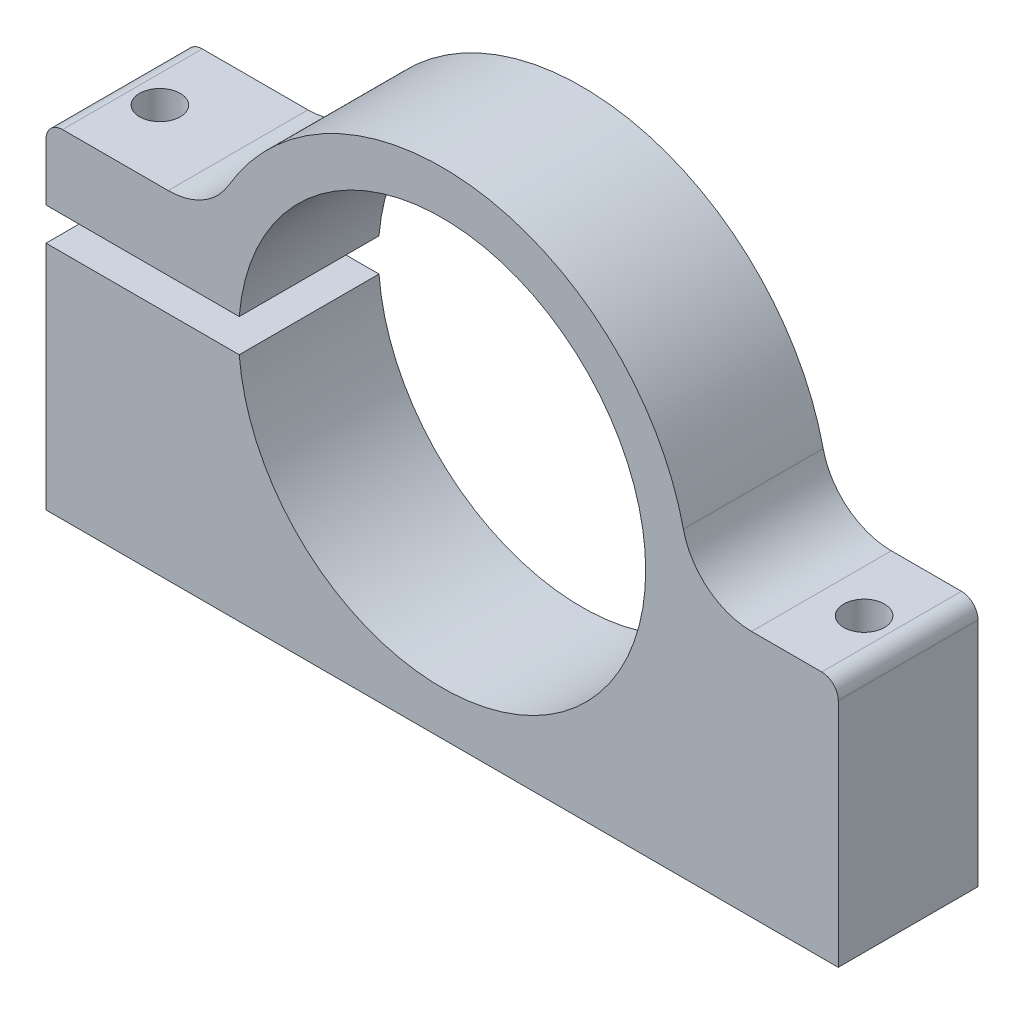
ISO-10303-21;
HEADER;
FILE_DESCRIPTION(('STEP AP214'),'2;1');
FILE_NAME('part.step','',(''),(''),'','','');
FILE_SCHEMA(('AUTOMOTIVE_DESIGN { 1 0 10303 214 1 1 1 1 }'));
ENDSEC;
DATA;
#1=APPLICATION_CONTEXT('core data for automotive mechanical design processes');
#2=APPLICATION_PROTOCOL_DEFINITION('international standard','automotive_design',2000,#1);
#3=PRODUCT_CONTEXT('',#1,'mechanical');
#4=PRODUCT('Part','Part','',(#3));
#5=PRODUCT_RELATED_PRODUCT_CATEGORY('part','',(#4));
#6=PRODUCT_DEFINITION_FORMATION('','',#4);
#7=PRODUCT_DEFINITION_CONTEXT('part definition',#1,'design');
#8=PRODUCT_DEFINITION('design','',#6,#7);
#9=PRODUCT_DEFINITION_SHAPE('','',#8);
#10=(LENGTH_UNIT() NAMED_UNIT(*) SI_UNIT(.MILLI.,.METRE.));
#11=(NAMED_UNIT(*) PLANE_ANGLE_UNIT() SI_UNIT($,.RADIAN.));
#12=(NAMED_UNIT(*) SI_UNIT($,.STERADIAN.) SOLID_ANGLE_UNIT());
#13=UNCERTAINTY_MEASURE_WITH_UNIT(LENGTH_MEASURE(1.E-05),#10,'distance_accuracy_value','');
#14=(GEOMETRIC_REPRESENTATION_CONTEXT(3) GLOBAL_UNCERTAINTY_ASSIGNED_CONTEXT((#13)) GLOBAL_UNIT_ASSIGNED_CONTEXT((#10,
#11,#12)) REPRESENTATION_CONTEXT('',''));
#15=CARTESIAN_POINT('',(0.,0.,0.));
#16=DIRECTION('',(0.,0.,1.));
#17=DIRECTION('',(1.,0.,0.));
#18=AXIS2_PLACEMENT_3D('',#15,#16,#17);
#19=CARTESIAN_POINT('',(-24.8593250544204,-22.3859153992928,0.400504127415026));
#20=DIRECTION('',(-1.,0.,0.));
#21=DIRECTION('',(0.,-1.,0.));
#22=AXIS2_PLACEMENT_3D('',#19,#20,#21);
#23=PLANE('',#22);
#24=DIRECTION('',(0.,1.,0.));
#25=VECTOR('',#24,1.);
#26=CARTESIAN_POINT('',(-24.8593250544204,-22.3859153992928,0.400504127415026));
#27=LINE('',#26,#25);
#28=CARTESIAN_POINT('',(-24.8593250544204,1.61408460070721,0.400504127415026));
#29=VERTEX_POINT('',#28);
#30=CARTESIAN_POINT('',(-24.8593250544204,6.80510216704338,0.400504127415026));
#31=VERTEX_POINT('',#30);
#32=EDGE_CURVE('E175',#29,#31,#27,.T.);
#33=ORIENTED_EDGE('',*,*,#32,.T.);
#34=DIRECTION('',(0.,0.,-1.));
#35=VECTOR('',#34,1.);
#36=CARTESIAN_POINT('',(-24.8593250544204,6.80510216704339,0.400504127415026));
#37=LINE('',#36,#35);
#38=CARTESIAN_POINT('',(-24.8593250544204,6.80510216704338,-12.299495872585));
#39=VERTEX_POINT('',#38);
#40=EDGE_CURVE('E207',#31,#39,#37,.T.);
#41=ORIENTED_EDGE('',*,*,#40,.T.);
#42=DIRECTION('',(0.,1.,0.));
#43=VECTOR('',#42,1.);
#44=CARTESIAN_POINT('',(-24.8593250544204,-22.3859153992928,-12.299495872585));
#45=LINE('',#44,#43);
#46=CARTESIAN_POINT('',(-24.8593250544204,1.61408460070721,-12.299495872585));
#47=VERTEX_POINT('',#46);
#48=EDGE_CURVE('E192',#47,#39,#45,.T.);
#49=ORIENTED_EDGE('',*,*,#48,.F.);
#50=DIRECTION('',(0.,0.,1.));
#51=VECTOR('',#50,1.);
#52=CARTESIAN_POINT('',(-24.8593250544204,1.61408460070721,-12.299495872585));
#53=LINE('',#52,#51);
#54=EDGE_CURVE('E158',#47,#29,#53,.T.);
#55=ORIENTED_EDGE('',*,*,#54,.T.);
#56=EDGE_LOOP('',(#33,#41,#49,#55));
#57=FACE_BOUND('',#56,.T.);
#58=ADVANCED_FACE('F32',(#57),#23,.T.);
#59=CARTESIAN_POINT('',(47.1406749455796,-22.3859153992928,0.400504127415026));
#60=DIRECTION('',(0.,-1.,0.));
#61=DIRECTION('',(0.,0.,-1.));
#62=AXIS2_PLACEMENT_3D('',#59,#60,#61);
#63=PLANE('',#62);
#64=CARTESIAN_POINT('',(-20.8593250544204,-22.3859153992928,-5.94949587258498));
#65=DIRECTION('',(0.,-1.,0.));
#66=DIRECTION('',(0.,0.,-1.));
#67=AXIS2_PLACEMENT_3D('',#64,#65,#66);
#68=CIRCLE('',#67,1.84999999999999);
#69=CARTESIAN_POINT('',(-20.8593250544204,-22.3859153992928,-7.79949587258497));
#70=VERTEX_POINT('',#69);
#71=EDGE_CURVE('E467',#70,#70,#68,.T.);
#72=ORIENTED_EDGE('',*,*,#71,.F.);
#73=EDGE_LOOP('',(#72));
#74=FACE_BOUND('',#73,.T.);
#75=CARTESIAN_POINT('',(43.1406749455796,-22.3859153992928,-5.94949587258498));
#76=DIRECTION('',(0.,1.,0.));
#77=DIRECTION('',(0.,0.,1.));
#78=AXIS2_PLACEMENT_3D('',#75,#76,#77);
#79=CIRCLE('',#78,1.84999999999998);
#80=CARTESIAN_POINT('',(43.1406749455796,-22.3859153992928,-4.09949587258499));
#81=VERTEX_POINT('',#80);
#82=EDGE_CURVE('E154',#81,#81,#79,.T.);
#83=ORIENTED_EDGE('',*,*,#82,.T.);
#84=EDGE_LOOP('',(#83));
#85=FACE_BOUND('',#84,.T.);
#86=DIRECTION('',(-1.,0.,0.));
#87=VECTOR('',#86,1.);
#88=CARTESIAN_POINT('',(47.1406749455796,-22.3859153992928,-12.299495872585));
#89=LINE('',#88,#87);
#90=CARTESIAN_POINT('',(47.1406749455796,-22.3859153992928,-12.299495872585));
#91=VERTEX_POINT('',#90);
#92=CARTESIAN_POINT('',(-24.8593250544204,-22.3859153992928,-12.299495872585));
#93=VERTEX_POINT('',#92);
#94=EDGE_CURVE('E142',#91,#93,#89,.T.);
#95=ORIENTED_EDGE('',*,*,#94,.F.);
#96=DIRECTION('',(0.,0.,-1.));
#97=VECTOR('',#96,1.);
#98=CARTESIAN_POINT('',(47.1406749455796,-22.3859153992928,0.400504127415026));
#99=LINE('',#98,#97);
#100=CARTESIAN_POINT('',(47.1406749455796,-22.3859153992928,0.400504127415026));
#101=VERTEX_POINT('',#100);
#102=EDGE_CURVE('E204',#101,#91,#99,.T.);
#103=ORIENTED_EDGE('',*,*,#102,.F.);
#104=DIRECTION('',(-1.,0.,0.));
#105=VECTOR('',#104,1.);
#106=CARTESIAN_POINT('',(47.1406749455796,-22.3859153992928,0.400504127415026));
#107=LINE('',#106,#105);
#108=CARTESIAN_POINT('',(-24.8593250544204,-22.3859153992928,0.400504127415026));
#109=VERTEX_POINT('',#108);
#110=EDGE_CURVE('E172',#101,#109,#107,.T.);
#111=ORIENTED_EDGE('',*,*,#110,.T.);
#112=DIRECTION('',(0.,0.,-1.));
#113=VECTOR('',#112,1.);
#114=CARTESIAN_POINT('',(-24.8593250544204,-22.3859153992928,0.400504127415026));
#115=LINE('',#114,#113);
#116=EDGE_CURVE('E189',#109,#93,#115,.T.);
#117=ORIENTED_EDGE('',*,*,#116,.T.);
#118=EDGE_LOOP('',(#95,#103,#111,#117));
#119=FACE_BOUND('',#118,.T.);
#120=ADVANCED_FACE('F267',(#74,#85,#119),#63,.T.);
#121=CARTESIAN_POINT('',(47.1406749455796,0.114084600707214,0.400504127415026));
#122=DIRECTION('',(1.,0.,0.));
#123=DIRECTION('',(0.,1.,0.));
#124=AXIS2_PLACEMENT_3D('',#121,#122,#123);
#125=PLANE('',#124);
#126=DIRECTION('',(0.,-1.,0.));
#127=VECTOR('',#126,1.);
#128=CARTESIAN_POINT('',(47.1406749455796,0.114084600707214,-12.299495872585));
#129=LINE('',#128,#127);
#130=CARTESIAN_POINT('',(47.1406749455796,-1.38591539929279,-12.299495872585));
#131=VERTEX_POINT('',#130);
#132=EDGE_CURVE('E176',#131,#91,#129,.T.);
#133=ORIENTED_EDGE('',*,*,#132,.F.);
#134=DIRECTION('',(0.,0.,-1.));
#135=VECTOR('',#134,1.);
#136=CARTESIAN_POINT('',(47.1406749455796,-1.38591539929279,0.400504127415026));
#137=LINE('',#136,#135);
#138=CARTESIAN_POINT('',(47.1406749455796,-1.38591539929279,0.400504127415026));
#139=VERTEX_POINT('',#138);
#140=EDGE_CURVE('E225',#131,#139,#137,.F.);
#141=ORIENTED_EDGE('',*,*,#140,.T.);
#142=DIRECTION('',(0.,-1.,0.));
#143=VECTOR('',#142,1.);
#144=CARTESIAN_POINT('',(47.1406749455796,0.114084600707214,0.400504127415026));
#145=LINE('',#144,#143);
#146=EDGE_CURVE('E187',#139,#101,#145,.T.);
#147=ORIENTED_EDGE('',*,*,#146,.T.);
#148=ORIENTED_EDGE('',*,*,#102,.T.);
#149=EDGE_LOOP('',(#133,#141,#147,#148));
#150=FACE_BOUND('',#149,.T.);
#151=ADVANCED_FACE('F285',(#150),#125,.T.);
#152=CARTESIAN_POINT('',(33.6206749455796,0.114084600707214,0.400504127415026));
#153=DIRECTION('',(0.,1.,0.));
#154=DIRECTION('',(-1.,0.,0.));
#155=AXIS2_PLACEMENT_3D('',#152,#153,#154);
#156=PLANE('',#155);
#157=CARTESIAN_POINT('',(43.1406749455796,0.114084600707215,-5.94949587258498));
#158=DIRECTION('',(0.,1.,0.));
#159=DIRECTION('',(0.,0.,1.));
#160=AXIS2_PLACEMENT_3D('',#157,#158,#159);
#161=CIRCLE('',#160,1.84999999999998);
#162=CARTESIAN_POINT('',(43.1406749455796,0.114084600707215,-4.09949587258499));
#163=VERTEX_POINT('',#162);
#164=EDGE_CURVE('E317',#163,#163,#161,.T.);
#165=ORIENTED_EDGE('',*,*,#164,.F.);
#166=EDGE_LOOP('',(#165));
#167=FACE_BOUND('',#166,.T.);
#168=DIRECTION('',(1.,0.,0.));
#169=VECTOR('',#168,1.);
#170=CARTESIAN_POINT('',(33.6206749455796,0.114084600707214,-12.299495872585));
#171=LINE('',#170,#169);
#172=CARTESIAN_POINT('',(39.2626663402159,0.114084600707214,-12.299495872585));
#173=VERTEX_POINT('',#172);
#174=CARTESIAN_POINT('',(45.6406749455796,0.114084600707214,-12.299495872585));
#175=VERTEX_POINT('',#174);
#176=EDGE_CURVE('E201',#173,#175,#171,.T.);
#177=ORIENTED_EDGE('',*,*,#176,.F.);
#178=DIRECTION('',(0.,0.,1.));
#179=VECTOR('',#178,1.);
#180=CARTESIAN_POINT('',(39.2626663402159,0.114084600707214,0.400504127415026));
#181=LINE('',#180,#179);
#182=CARTESIAN_POINT('',(39.2626663402159,0.114084600707214,0.400504127415026));
#183=VERTEX_POINT('',#182);
#184=EDGE_CURVE('E232',#173,#183,#181,.T.);
#185=ORIENTED_EDGE('',*,*,#184,.T.);
#186=DIRECTION('',(1.,0.,0.));
#187=VECTOR('',#186,1.);
#188=CARTESIAN_POINT('',(33.6206749455796,0.114084600707214,0.400504127415026));
#189=LINE('',#188,#187);
#190=CARTESIAN_POINT('',(45.6406749455796,0.114084600707214,0.400504127415026));
#191=VERTEX_POINT('',#190);
#192=EDGE_CURVE('E185',#183,#191,#189,.T.);
#193=ORIENTED_EDGE('',*,*,#192,.T.);
#194=DIRECTION('',(0.,0.,-1.));
#195=VECTOR('',#194,1.);
#196=CARTESIAN_POINT('',(45.6406749455796,0.114084600707214,0.400504127415026));
#197=LINE('',#196,#195);
#198=EDGE_CURVE('E222',#191,#175,#197,.T.);
#199=ORIENTED_EDGE('',*,*,#198,.T.);
#200=EDGE_LOOP('',(#177,#185,#193,#199));
#201=FACE_BOUND('',#200,.T.);
#202=ADVANCED_FACE('F280',(#167,#201),#156,.T.);
#203=CARTESIAN_POINT('',(11.1406749455796,0.114084600707214,0.400504127415026));
#204=DIRECTION('',(0.,0.,-1.));
#205=DIRECTION('',(-1.,0.,0.));
#206=AXIS2_PLACEMENT_3D('',#203,#204,#205);
#207=CYLINDRICAL_SURFACE('',#206,22.48);
#208=CARTESIAN_POINT('',(11.1406749455796,0.114084600707214,0.400504127415026));
#209=DIRECTION('',(0.,0.,-1.));
#210=DIRECTION('',(-1.,0.,0.));
#211=AXIS2_PLACEMENT_3D('',#208,#209,#210);
#212=CIRCLE('',#211,22.48);
#213=CARTESIAN_POINT('',(-8.27051330822913,11.4523459566294,0.400504127415026));
#214=VERTEX_POINT('',#213);
#215=CARTESIAN_POINT('',(33.068609962972,5.06545470129688,0.400504127415026));
#216=VERTEX_POINT('',#215);
#217=EDGE_CURVE('E182',#214,#216,#212,.T.);
#218=ORIENTED_EDGE('',*,*,#217,.T.);
#219=DIRECTION('',(0.,0.,-1.));
#220=VECTOR('',#219,1.);
#221=CARTESIAN_POINT('',(33.068609962972,5.06545470129688,0.400504127415026));
#222=LINE('',#221,#220);
#223=CARTESIAN_POINT('',(33.068609962972,5.06545470129688,-12.299495872585));
#224=VERTEX_POINT('',#223);
#225=EDGE_CURVE('E229',#216,#224,#222,.T.);
#226=ORIENTED_EDGE('',*,*,#225,.T.);
#227=CARTESIAN_POINT('',(11.1406749455796,0.114084600707214,-12.299495872585));
#228=DIRECTION('',(0.,0.,-1.));
#229=DIRECTION('',(-1.,0.,0.));
#230=AXIS2_PLACEMENT_3D('',#227,#228,#229);
#231=CIRCLE('',#230,22.48);
#232=CARTESIAN_POINT('',(-8.27051330822913,11.4523459566294,-12.299495872585));
#233=VERTEX_POINT('',#232);
#234=EDGE_CURVE('E198',#233,#224,#231,.T.);
#235=ORIENTED_EDGE('',*,*,#234,.F.);
#236=DIRECTION('',(0.,0.,-1.));
#237=VECTOR('',#236,1.);
#238=CARTESIAN_POINT('',(-8.27051330822913,11.4523459566294,0.400504127415026));
#239=LINE('',#238,#237);
#240=EDGE_CURVE('E227',#233,#214,#239,.F.);
#241=ORIENTED_EDGE('',*,*,#240,.T.);
#242=EDGE_LOOP('',(#218,#226,#235,#241));
#243=FACE_BOUND('',#242,.T.);
#244=ADVANCED_FACE('F242',(#243),#207,.T.);
#245=CARTESIAN_POINT('',(-24.8593250544204,8.30510216704339,0.400504127415026));
#246=DIRECTION('',(0.,1.,0.));
#247=DIRECTION('',(-1.,0.,0.));
#248=AXIS2_PLACEMENT_3D('',#245,#246,#247);
#249=PLANE('',#248);
#250=CARTESIAN_POINT('',(-20.8593250544204,8.30510216704339,-5.94949587258498));
#251=DIRECTION('',(0.,1.,0.));
#252=DIRECTION('',(-1.,0.,0.));
#253=AXIS2_PLACEMENT_3D('',#250,#251,#252);
#254=CIRCLE('',#253,1.84999999999999);
#255=CARTESIAN_POINT('',(-22.7093250544204,8.30510216704339,-5.94949587258498));
#256=VERTEX_POINT('',#255);
#257=EDGE_CURVE('E315',#256,#256,#254,.T.);
#258=ORIENTED_EDGE('',*,*,#257,.F.);
#259=EDGE_LOOP('',(#258));
#260=FACE_BOUND('',#259,.T.);
#261=DIRECTION('',(1.,0.,0.));
#262=VECTOR('',#261,1.);
#263=CARTESIAN_POINT('',(-24.8593250544204,8.30510216704339,0.400504127415026));
#264=LINE('',#263,#262);
#265=CARTESIAN_POINT('',(-23.3593250544204,8.30510216704339,0.400504127415026));
#266=VERTEX_POINT('',#265);
#267=CARTESIAN_POINT('',(-13.7536558977169,8.30510216704339,0.400504127415026));
#268=VERTEX_POINT('',#267);
#269=EDGE_CURVE('E180',#266,#268,#264,.T.);
#270=ORIENTED_EDGE('',*,*,#269,.T.);
#271=DIRECTION('',(0.,0.,1.));
#272=VECTOR('',#271,1.);
#273=CARTESIAN_POINT('',(-13.7536558977169,8.30510216704339,-12.299495872585));
#274=LINE('',#273,#272);
#275=CARTESIAN_POINT('',(-13.7536558977169,8.30510216704339,-12.299495872585));
#276=VERTEX_POINT('',#275);
#277=EDGE_CURVE('E234',#268,#276,#274,.F.);
#278=ORIENTED_EDGE('',*,*,#277,.T.);
#279=DIRECTION('',(1.,0.,0.));
#280=VECTOR('',#279,1.);
#281=CARTESIAN_POINT('',(-24.8593250544204,8.30510216704339,-12.299495872585));
#282=LINE('',#281,#280);
#283=CARTESIAN_POINT('',(-23.3593250544204,8.30510216704339,-12.299495872585));
#284=VERTEX_POINT('',#283);
#285=EDGE_CURVE('E195',#284,#276,#282,.T.);
#286=ORIENTED_EDGE('',*,*,#285,.F.);
#287=DIRECTION('',(0.,0.,-1.));
#288=VECTOR('',#287,1.);
#289=CARTESIAN_POINT('',(-23.3593250544204,8.30510216704339,0.400504127415026));
#290=LINE('',#289,#288);
#291=EDGE_CURVE('E215',#284,#266,#290,.F.);
#292=ORIENTED_EDGE('',*,*,#291,.T.);
#293=EDGE_LOOP('',(#270,#278,#286,#292));
#294=FACE_BOUND('',#293,.T.);
#295=ADVANCED_FACE('F245',(#260,#294),#249,.T.);
#296=DIRECTION('',(0.,0.,1.));
#297=VECTOR('',#296,1.);
#298=CARTESIAN_POINT('',(-24.8593250544204,-1.38591539929279,-12.299495872585));
#299=LINE('',#298,#297);
#300=CARTESIAN_POINT('',(-24.8593250544204,-1.38591539929279,-12.299495872585));
#301=VERTEX_POINT('',#300);
#302=CARTESIAN_POINT('',(-24.8593250544204,-1.38591539929279,0.400504127415026));
#303=VERTEX_POINT('',#302);
#304=EDGE_CURVE('E169',#301,#303,#299,.T.);
#305=ORIENTED_EDGE('',*,*,#304,.F.);
#306=EDGE_CURVE('E193',#93,#301,#45,.T.);
#307=ORIENTED_EDGE('',*,*,#306,.F.);
#308=ORIENTED_EDGE('',*,*,#116,.F.);
#309=EDGE_CURVE('E177',#109,#303,#27,.T.);
#310=ORIENTED_EDGE('',*,*,#309,.T.);
#311=EDGE_LOOP('',(#305,#307,#308,#310));
#312=FACE_BOUND('',#311,.T.);
#313=ADVANCED_FACE('F262',(#312),#23,.T.);
#314=CARTESIAN_POINT('',(11.1406749455796,0.114084600707214,0.400504127415026));
#315=DIRECTION('',(0.,0.,-1.));
#316=DIRECTION('',(-1.,0.,0.));
#317=AXIS2_PLACEMENT_3D('',#314,#315,#316);
#318=PLANE('',#317);
#319=ORIENTED_EDGE('',*,*,#269,.F.);
#320=CARTESIAN_POINT('',(-23.3593250544204,6.80510216704339,0.400504127415026));
#321=DIRECTION('',(0.,0.,-1.));
#322=DIRECTION('',(-1.,0.,0.));
#323=AXIS2_PLACEMENT_3D('',#320,#321,#322);
#324=CIRCLE('',#323,1.5);
#325=EDGE_CURVE('E220',#266,#31,#324,.F.);
#326=ORIENTED_EDGE('',*,*,#325,.T.);
#327=ORIENTED_EDGE('',*,*,#32,.F.);
#328=DIRECTION('',(-1.,0.,0.));
#329=VECTOR('',#328,1.);
#330=CARTESIAN_POINT('',(-7.2984139690062,1.61408460070721,0.400504127415026));
#331=LINE('',#330,#329);
#332=CARTESIAN_POINT('',(-7.2984139690062,1.61408460070721,0.400504127415024));
#333=VERTEX_POINT('',#332);
#334=EDGE_CURVE('E163',#333,#29,#331,.T.);
#335=ORIENTED_EDGE('',*,*,#334,.F.);
#336=CARTESIAN_POINT('',(11.1406749455796,0.114084600707214,0.400504127415024));
#337=DIRECTION('',(0.,0.,-1.));
#338=DIRECTION('',(-1.,0.,0.));
#339=AXIS2_PLACEMENT_3D('',#336,#337,#338);
#340=CIRCLE('',#339,18.5);
#341=CARTESIAN_POINT('',(-7.29841396900619,-1.38591539929284,0.400504127415024));
#342=VERTEX_POINT('',#341);
#343=EDGE_CURVE('E138',#333,#342,#340,.T.);
#344=ORIENTED_EDGE('',*,*,#343,.T.);
#345=DIRECTION('',(1.,0.,0.));
#346=VECTOR('',#345,1.);
#347=CARTESIAN_POINT('',(-24.8593250544204,-1.38591539929279,0.400504127415026));
#348=LINE('',#347,#346);
#349=EDGE_CURVE('E159',#303,#342,#348,.T.);
#350=ORIENTED_EDGE('',*,*,#349,.F.);
#351=ORIENTED_EDGE('',*,*,#309,.F.);
#352=ORIENTED_EDGE('',*,*,#110,.F.);
#353=ORIENTED_EDGE('',*,*,#146,.F.);
#354=CARTESIAN_POINT('',(45.6406749455796,-1.38591539929279,0.400504127415026));
#355=DIRECTION('',(0.,0.,-1.));
#356=DIRECTION('',(-1.,0.,0.));
#357=AXIS2_PLACEMENT_3D('',#354,#355,#356);
#358=CIRCLE('',#357,1.5);
#359=EDGE_CURVE('E217',#139,#191,#358,.F.);
#360=ORIENTED_EDGE('',*,*,#359,.T.);
#361=ORIENTED_EDGE('',*,*,#192,.F.);
#362=CARTESIAN_POINT('',(39.2626663402159,6.46408460070721,0.400504127415026));
#363=DIRECTION('',(0.,0.,-1.));
#364=DIRECTION('',(-1.,0.,0.));
#365=AXIS2_PLACEMENT_3D('',#362,#363,#364);
#366=CIRCLE('',#365,6.35);
#367=EDGE_CURVE('E238',#183,#216,#366,.T.);
#368=ORIENTED_EDGE('',*,*,#367,.T.);
#369=ORIENTED_EDGE('',*,*,#217,.F.);
#370=CARTESIAN_POINT('',(-13.7536558977169,14.6551021670434,0.400504127415026));
#371=DIRECTION('',(0.,0.,-1.));
#372=DIRECTION('',(-1.,0.,0.));
#373=AXIS2_PLACEMENT_3D('',#370,#371,#372);
#374=CIRCLE('',#373,6.35);
#375=EDGE_CURVE('E11',#214,#268,#374,.T.);
#376=ORIENTED_EDGE('',*,*,#375,.T.);
#377=EDGE_LOOP('',(#319,#326,#327,#335,#344,#350,#351,#352,#353,#360,#361,#368,#369,#376));
#378=FACE_BOUND('',#377,.T.);
#379=ADVANCED_FACE('F248',(#378),#318,.F.);
#380=CARTESIAN_POINT('',(11.1406749455796,0.114084600707214,-12.299495872585));
#381=DIRECTION('',(0.,0.,-1.));
#382=DIRECTION('',(-1.,0.,0.));
#383=AXIS2_PLACEMENT_3D('',#380,#381,#382);
#384=PLANE('',#383);
#385=ORIENTED_EDGE('',*,*,#48,.T.);
#386=CARTESIAN_POINT('',(-23.3593250544204,6.80510216704339,-12.299495872585));
#387=DIRECTION('',(0.,0.,-1.));
#388=DIRECTION('',(-1.,0.,0.));
#389=AXIS2_PLACEMENT_3D('',#386,#387,#388);
#390=CIRCLE('',#389,1.5);
#391=EDGE_CURVE('E213',#39,#284,#390,.T.);
#392=ORIENTED_EDGE('',*,*,#391,.T.);
#393=ORIENTED_EDGE('',*,*,#285,.T.);
#394=CARTESIAN_POINT('',(-13.7536558977169,14.6551021670434,-12.299495872585));
#395=DIRECTION('',(0.,0.,-1.));
#396=DIRECTION('',(-1.,0.,0.));
#397=AXIS2_PLACEMENT_3D('',#394,#395,#396);
#398=CIRCLE('',#397,6.35);
#399=EDGE_CURVE('E40',#276,#233,#398,.F.);
#400=ORIENTED_EDGE('',*,*,#399,.T.);
#401=ORIENTED_EDGE('',*,*,#234,.T.);
#402=CARTESIAN_POINT('',(39.2626663402159,6.46408460070721,-12.299495872585));
#403=DIRECTION('',(0.,0.,-1.));
#404=DIRECTION('',(-1.,0.,0.));
#405=AXIS2_PLACEMENT_3D('',#402,#403,#404);
#406=CIRCLE('',#405,6.35);
#407=EDGE_CURVE('E236',#224,#173,#406,.F.);
#408=ORIENTED_EDGE('',*,*,#407,.T.);
#409=ORIENTED_EDGE('',*,*,#176,.T.);
#410=CARTESIAN_POINT('',(45.6406749455796,-1.38591539929279,-12.299495872585));
#411=DIRECTION('',(0.,0.,-1.));
#412=DIRECTION('',(-1.,0.,0.));
#413=AXIS2_PLACEMENT_3D('',#410,#411,#412);
#414=CIRCLE('',#413,1.5);
#415=EDGE_CURVE('E211',#175,#131,#414,.T.);
#416=ORIENTED_EDGE('',*,*,#415,.T.);
#417=ORIENTED_EDGE('',*,*,#132,.T.);
#418=ORIENTED_EDGE('',*,*,#94,.T.);
#419=ORIENTED_EDGE('',*,*,#306,.T.);
#420=DIRECTION('',(1.,0.,0.));
#421=VECTOR('',#420,1.);
#422=CARTESIAN_POINT('',(-24.8593250544204,-1.38591539929279,-12.299495872585));
#423=LINE('',#422,#421);
#424=CARTESIAN_POINT('',(-7.29841396900619,-1.38591539929284,-12.299495872585));
#425=VERTEX_POINT('',#424);
#426=EDGE_CURVE('E153',#301,#425,#423,.T.);
#427=ORIENTED_EDGE('',*,*,#426,.T.);
#428=CARTESIAN_POINT('',(11.1406749455796,0.114084600707214,-12.299495872585));
#429=DIRECTION('',(0.,0.,-1.));
#430=DIRECTION('',(-1.,0.,0.));
#431=AXIS2_PLACEMENT_3D('',#428,#429,#430);
#432=CIRCLE('',#431,18.5);
#433=CARTESIAN_POINT('',(-7.2984139690062,1.61408460070721,-12.299495872585));
#434=VERTEX_POINT('',#433);
#435=EDGE_CURVE('E135',#434,#425,#432,.T.);
#436=ORIENTED_EDGE('',*,*,#435,.F.);
#437=DIRECTION('',(-1.,0.,0.));
#438=VECTOR('',#437,1.);
#439=CARTESIAN_POINT('',(-7.2984139690062,1.61408460070721,-12.299495872585));
#440=LINE('',#439,#438);
#441=EDGE_CURVE('E150',#434,#47,#440,.T.);
#442=ORIENTED_EDGE('',*,*,#441,.T.);
#443=EDGE_LOOP('',(#385,#392,#393,#400,#401,#408,#409,#416,#417,#418,#419,#427,#436,#442));
#444=FACE_BOUND('',#443,.T.);
#445=ADVANCED_FACE('F149',(#444),#384,.T.);
#446=CARTESIAN_POINT('',(-7.2984139690062,1.61408460070721,-12.299495872585));
#447=DIRECTION('',(0.,1.,0.));
#448=DIRECTION('',(-1.,0.,0.));
#449=AXIS2_PLACEMENT_3D('',#446,#447,#448);
#450=PLANE('',#449);
#451=CARTESIAN_POINT('',(-20.8593250544204,1.61408460070721,-5.94949587258498));
#452=DIRECTION('',(0.,-1.,0.));
#453=DIRECTION('',(0.,0.,-1.));
#454=AXIS2_PLACEMENT_3D('',#451,#452,#453);
#455=CIRCLE('',#454,1.84999999999999);
#456=CARTESIAN_POINT('',(-20.8593250544204,1.61408460070721,-7.79949587258496));
#457=VERTEX_POINT('',#456);
#458=EDGE_CURVE('E318',#457,#457,#455,.T.);
#459=ORIENTED_EDGE('',*,*,#458,.F.);
#460=EDGE_LOOP('',(#459));
#461=FACE_BOUND('',#460,.T.);
#462=ORIENTED_EDGE('',*,*,#334,.T.);
#463=ORIENTED_EDGE('',*,*,#54,.F.);
#464=ORIENTED_EDGE('',*,*,#441,.F.);
#465=DIRECTION('',(0.,0.,1.));
#466=VECTOR('',#465,1.);
#467=CARTESIAN_POINT('',(-7.2984139690062,1.61408460070721,-12.299495872585));
#468=LINE('',#467,#466);
#469=EDGE_CURVE('E132',#434,#333,#468,.T.);
#470=ORIENTED_EDGE('',*,*,#469,.T.);
#471=EDGE_LOOP('',(#462,#463,#464,#470));
#472=FACE_BOUND('',#471,.T.);
#473=ADVANCED_FACE('F156',(#461,#472),#450,.F.);
#474=CARTESIAN_POINT('',(-24.8593250544204,-1.38591539929279,-12.299495872585));
#475=DIRECTION('',(0.,-1.,0.));
#476=DIRECTION('',(1.,0.,0.));
#477=AXIS2_PLACEMENT_3D('',#474,#475,#476);
#478=PLANE('',#477);
#479=CARTESIAN_POINT('',(-20.8593250544204,-1.3859153992928,-5.94949587258498));
#480=DIRECTION('',(0.,-1.,0.));
#481=DIRECTION('',(1.,0.,0.));
#482=AXIS2_PLACEMENT_3D('',#479,#480,#481);
#483=CIRCLE('',#482,1.84999999999999);
#484=CARTESIAN_POINT('',(-19.0093250544204,-1.38591539929281,-5.94949587258498));
#485=VERTEX_POINT('',#484);
#486=EDGE_CURVE('E323',#485,#485,#483,.T.);
#487=ORIENTED_EDGE('',*,*,#486,.T.);
#488=EDGE_LOOP('',(#487));
#489=FACE_BOUND('',#488,.T.);
#490=ORIENTED_EDGE('',*,*,#349,.T.);
#491=DIRECTION('',(0.,0.,1.));
#492=VECTOR('',#491,1.);
#493=CARTESIAN_POINT('',(-7.29841396900619,-1.38591539929284,-12.299495872585));
#494=LINE('',#493,#492);
#495=EDGE_CURVE('E143',#425,#342,#494,.T.);
#496=ORIENTED_EDGE('',*,*,#495,.F.);
#497=ORIENTED_EDGE('',*,*,#426,.F.);
#498=ORIENTED_EDGE('',*,*,#304,.T.);
#499=EDGE_LOOP('',(#490,#496,#497,#498));
#500=FACE_BOUND('',#499,.T.);
#501=ADVANCED_FACE('F258',(#489,#500),#478,.F.);
#502=CARTESIAN_POINT('',(11.1406749455796,0.114084600707214,0.400504127415024));
#503=DIRECTION('',(0.,0.,-1.));
#504=DIRECTION('',(-1.,0.,0.));
#505=AXIS2_PLACEMENT_3D('',#502,#503,#504);
#506=CYLINDRICAL_SURFACE('',#505,18.5);
#507=ORIENTED_EDGE('',*,*,#435,.T.);
#508=ORIENTED_EDGE('',*,*,#495,.T.);
#509=ORIENTED_EDGE('',*,*,#343,.F.);
#510=ORIENTED_EDGE('',*,*,#469,.F.);
#511=EDGE_LOOP('',(#507,#508,#509,#510));
#512=FACE_BOUND('',#511,.T.);
#513=ADVANCED_FACE('F134',(#512),#506,.F.);
#514=CARTESIAN_POINT('',(43.1406749455796,0.114084600707214,-5.94949587258498));
#515=DIRECTION('',(0.,1.,0.));
#516=DIRECTION('',(0.,0.,1.));
#517=AXIS2_PLACEMENT_3D('',#514,#515,#516);
#518=CYLINDRICAL_SURFACE('',#517,1.84999999999998);
#519=ORIENTED_EDGE('',*,*,#82,.F.);
#520=EDGE_LOOP('',(#519));
#521=FACE_BOUND('',#520,.T.);
#522=ORIENTED_EDGE('',*,*,#164,.T.);
#523=EDGE_LOOP('',(#522));
#524=FACE_BOUND('',#523,.T.);
#525=ADVANCED_FACE('F331',(#521,#524),#518,.F.);
#526=CARTESIAN_POINT('',(-20.8593250544204,1.61408460070721,-5.94949587258498));
#527=DIRECTION('',(0.,-1.,0.));
#528=DIRECTION('',(0.,0.,-1.));
#529=AXIS2_PLACEMENT_3D('',#526,#527,#528);
#530=CYLINDRICAL_SURFACE('',#529,1.84999999999999);
#531=ORIENTED_EDGE('',*,*,#257,.T.);
#532=EDGE_LOOP('',(#531));
#533=FACE_BOUND('',#532,.T.);
#534=ORIENTED_EDGE('',*,*,#458,.T.);
#535=EDGE_LOOP('',(#534));
#536=FACE_BOUND('',#535,.T.);
#537=ADVANCED_FACE('F334',(#533,#536),#530,.F.);
#538=CARTESIAN_POINT('',(-20.8593250544204,-22.3859153992928,-5.94949587258498));
#539=DIRECTION('',(0.,-1.,0.));
#540=DIRECTION('',(0.,0.,-1.));
#541=AXIS2_PLACEMENT_3D('',#538,#539,#540);
#542=CYLINDRICAL_SURFACE('',#541,1.84999999999999);
#543=ORIENTED_EDGE('',*,*,#71,.T.);
#544=EDGE_LOOP('',(#543));
#545=FACE_BOUND('',#544,.T.);
#546=ORIENTED_EDGE('',*,*,#486,.F.);
#547=EDGE_LOOP('',(#546));
#548=FACE_BOUND('',#547,.T.);
#549=ADVANCED_FACE('F341',(#545,#548),#542,.F.);
#550=CARTESIAN_POINT('',(-23.3593250544204,6.80510216704339,0.400504127415026));
#551=DIRECTION('',(0.,0.,-1.));
#552=DIRECTION('',(-1.,0.,0.));
#553=AXIS2_PLACEMENT_3D('',#550,#551,#552);
#554=CYLINDRICAL_SURFACE('',#553,1.5);
#555=ORIENTED_EDGE('',*,*,#325,.F.);
#556=ORIENTED_EDGE('',*,*,#291,.F.);
#557=ORIENTED_EDGE('',*,*,#391,.F.);
#558=ORIENTED_EDGE('',*,*,#40,.F.);
#559=EDGE_LOOP('',(#555,#556,#557,#558));
#560=FACE_BOUND('',#559,.T.);
#561=ADVANCED_FACE('F253',(#560),#554,.T.);
#562=CARTESIAN_POINT('',(45.6406749455796,-1.38591539929279,0.400504127415026));
#563=DIRECTION('',(0.,0.,-1.));
#564=DIRECTION('',(-1.,0.,0.));
#565=AXIS2_PLACEMENT_3D('',#562,#563,#564);
#566=CYLINDRICAL_SURFACE('',#565,1.5);
#567=ORIENTED_EDGE('',*,*,#359,.F.);
#568=ORIENTED_EDGE('',*,*,#140,.F.);
#569=ORIENTED_EDGE('',*,*,#415,.F.);
#570=ORIENTED_EDGE('',*,*,#198,.F.);
#571=EDGE_LOOP('',(#567,#568,#569,#570));
#572=FACE_BOUND('',#571,.T.);
#573=ADVANCED_FACE('F276',(#572),#566,.T.);
#574=CARTESIAN_POINT('',(39.2626663402159,6.46408460070721,0.400504127415026));
#575=DIRECTION('',(0.,0.,-1.));
#576=DIRECTION('',(-1.,0.,0.));
#577=AXIS2_PLACEMENT_3D('',#574,#575,#576);
#578=CYLINDRICAL_SURFACE('',#577,6.35);
#579=ORIENTED_EDGE('',*,*,#367,.F.);
#580=ORIENTED_EDGE('',*,*,#184,.F.);
#581=ORIENTED_EDGE('',*,*,#407,.F.);
#582=ORIENTED_EDGE('',*,*,#225,.F.);
#583=EDGE_LOOP('',(#579,#580,#581,#582));
#584=FACE_BOUND('',#583,.T.);
#585=ADVANCED_FACE('F284',(#584),#578,.F.);
#586=CARTESIAN_POINT('',(-13.7536558977169,14.6551021670434,0.400504127415026));
#587=DIRECTION('',(0.,0.,-1.));
#588=DIRECTION('',(-1.,0.,0.));
#589=AXIS2_PLACEMENT_3D('',#586,#587,#588);
#590=CYLINDRICAL_SURFACE('',#589,6.35);
#591=ORIENTED_EDGE('',*,*,#375,.F.);
#592=ORIENTED_EDGE('',*,*,#240,.F.);
#593=ORIENTED_EDGE('',*,*,#399,.F.);
#594=ORIENTED_EDGE('',*,*,#277,.F.);
#595=EDGE_LOOP('',(#591,#592,#593,#594));
#596=FACE_BOUND('',#595,.T.);
#597=ADVANCED_FACE('F34',(#596),#590,.F.);
#598=CLOSED_SHELL('',(#58,#120,#151,#202,#244,#295,#313,#379,#445,#473,#501,#513,#525,#537,#549,
#561,#573,#585,#597));
#599=MANIFOLD_SOLID_BREP('B2',#598);
#600=ADVANCED_BREP_SHAPE_REPRESENTATION('',(#18,#599),#14);
#601=SHAPE_DEFINITION_REPRESENTATION(#9,#600);
ENDSEC;
END-ISO-10303-21;
